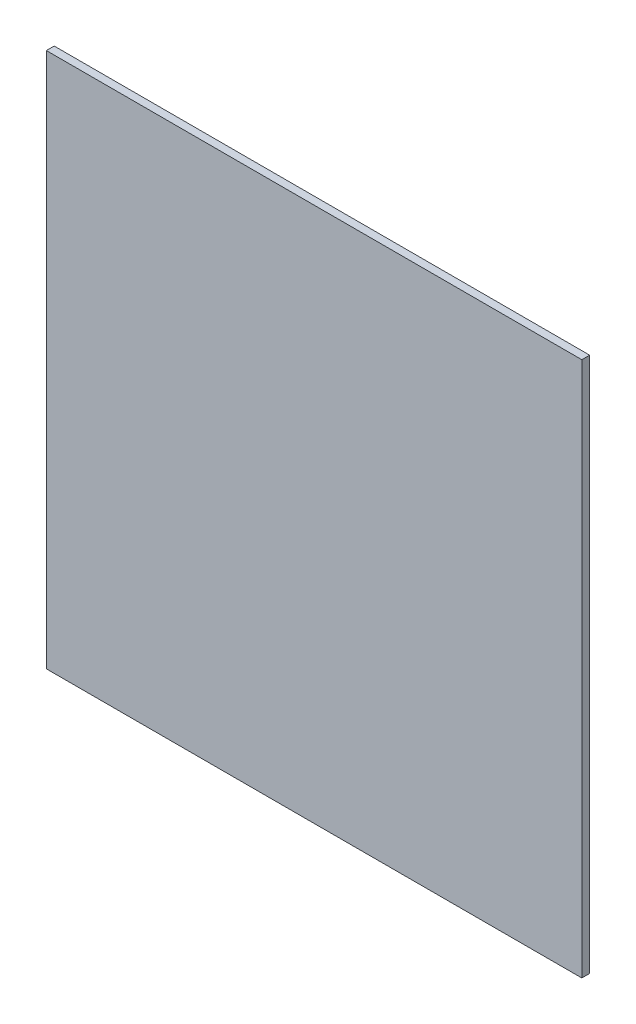
ISO-10303-21;
HEADER;
FILE_DESCRIPTION(('STEP AP214'),'2;1');
FILE_NAME('part.step','',(''),(''),'','','');
FILE_SCHEMA(('AUTOMOTIVE_DESIGN { 1 0 10303 214 1 1 1 1 }'));
ENDSEC;
DATA;
#1=APPLICATION_CONTEXT('core data for automotive mechanical design processes');
#2=APPLICATION_PROTOCOL_DEFINITION('international standard','automotive_design',2000,#1);
#3=PRODUCT_CONTEXT('',#1,'mechanical');
#4=PRODUCT('Part','Part','',(#3));
#5=PRODUCT_RELATED_PRODUCT_CATEGORY('part','',(#4));
#6=PRODUCT_DEFINITION_FORMATION('','',#4);
#7=PRODUCT_DEFINITION_CONTEXT('part definition',#1,'design');
#8=PRODUCT_DEFINITION('design','',#6,#7);
#9=PRODUCT_DEFINITION_SHAPE('','',#8);
#10=(LENGTH_UNIT() NAMED_UNIT(*) SI_UNIT(.MILLI.,.METRE.));
#11=(NAMED_UNIT(*) PLANE_ANGLE_UNIT() SI_UNIT($,.RADIAN.));
#12=(NAMED_UNIT(*) SI_UNIT($,.STERADIAN.) SOLID_ANGLE_UNIT());
#13=UNCERTAINTY_MEASURE_WITH_UNIT(LENGTH_MEASURE(1.E-05),#10,'distance_accuracy_value','');
#14=(GEOMETRIC_REPRESENTATION_CONTEXT(3) GLOBAL_UNCERTAINTY_ASSIGNED_CONTEXT((#13)) GLOBAL_UNIT_ASSIGNED_CONTEXT((#10,
#11,#12)) REPRESENTATION_CONTEXT('',''));
#15=CARTESIAN_POINT('',(0.,0.,0.));
#16=DIRECTION('',(0.,0.,1.));
#17=DIRECTION('',(1.,0.,0.));
#18=AXIS2_PLACEMENT_3D('',#15,#16,#17);
#19=CARTESIAN_POINT('',(-25.,25.,1.1));
#20=DIRECTION('',(1.,0.,0.));
#21=DIRECTION('',(0.,1.,0.));
#22=AXIS2_PLACEMENT_3D('',#19,#20,#21);
#23=PLANE('',#22);
#24=DIRECTION('',(0.,-1.,0.));
#25=VECTOR('',#24,1.);
#26=CARTESIAN_POINT('',(-25.,25.,0.));
#27=LINE('',#26,#25);
#28=CARTESIAN_POINT('',(-25.,25.,0.));
#29=VERTEX_POINT('',#28);
#30=CARTESIAN_POINT('',(-25.,-50.,0.));
#31=VERTEX_POINT('',#30);
#32=EDGE_CURVE('E96',#29,#31,#27,.T.);
#33=ORIENTED_EDGE('',*,*,#32,.T.);
#34=DIRECTION('',(0.,0.,-1.));
#35=VECTOR('',#34,1.);
#36=CARTESIAN_POINT('',(-25.,-50.,1.1));
#37=LINE('',#36,#35);
#38=CARTESIAN_POINT('',(-25.,-50.,1.1));
#39=VERTEX_POINT('',#38);
#40=EDGE_CURVE('E11',#39,#31,#37,.T.);
#41=ORIENTED_EDGE('',*,*,#40,.F.);
#42=DIRECTION('',(0.,-1.,0.));
#43=VECTOR('',#42,1.);
#44=CARTESIAN_POINT('',(-25.,25.,1.1));
#45=LINE('',#44,#43);
#46=CARTESIAN_POINT('',(-25.,25.,1.1));
#47=VERTEX_POINT('',#46);
#48=EDGE_CURVE('E84',#47,#39,#45,.T.);
#49=ORIENTED_EDGE('',*,*,#48,.F.);
#50=DIRECTION('',(0.,0.,-1.));
#51=VECTOR('',#50,1.);
#52=CARTESIAN_POINT('',(-25.,25.,1.1));
#53=LINE('',#52,#51);
#54=EDGE_CURVE('E92',#47,#29,#53,.T.);
#55=ORIENTED_EDGE('',*,*,#54,.T.);
#56=EDGE_LOOP('',(#33,#41,#49,#55));
#57=FACE_BOUND('',#56,.T.);
#58=ADVANCED_FACE('F33',(#57),#23,.F.);
#59=CARTESIAN_POINT('',(-25.,-50.,1.1));
#60=DIRECTION('',(0.,1.,0.));
#61=DIRECTION('',(0.,0.,1.));
#62=AXIS2_PLACEMENT_3D('',#59,#60,#61);
#63=PLANE('',#62);
#64=DIRECTION('',(1.,0.,0.));
#65=VECTOR('',#64,1.);
#66=CARTESIAN_POINT('',(-25.,-50.,0.));
#67=LINE('',#66,#65);
#68=CARTESIAN_POINT('',(50.,-50.,0.));
#69=VERTEX_POINT('',#68);
#70=EDGE_CURVE('E88',#31,#69,#67,.T.);
#71=ORIENTED_EDGE('',*,*,#70,.T.);
#72=DIRECTION('',(0.,0.,-1.));
#73=VECTOR('',#72,1.);
#74=CARTESIAN_POINT('',(50.,-50.,1.1));
#75=LINE('',#74,#73);
#76=CARTESIAN_POINT('',(50.,-50.,1.1));
#77=VERTEX_POINT('',#76);
#78=EDGE_CURVE('E41',#77,#69,#75,.T.);
#79=ORIENTED_EDGE('',*,*,#78,.F.);
#80=DIRECTION('',(1.,0.,0.));
#81=VECTOR('',#80,1.);
#82=CARTESIAN_POINT('',(-25.,-50.,1.1));
#83=LINE('',#82,#81);
#84=EDGE_CURVE('E79',#39,#77,#83,.T.);
#85=ORIENTED_EDGE('',*,*,#84,.F.);
#86=ORIENTED_EDGE('',*,*,#40,.T.);
#87=EDGE_LOOP('',(#71,#79,#85,#86));
#88=FACE_BOUND('',#87,.T.);
#89=ADVANCED_FACE('F87',(#88),#63,.F.);
#90=CARTESIAN_POINT('',(50.,25.,1.1));
#91=DIRECTION('',(-1.,0.,0.));
#92=DIRECTION('',(0.,-1.,0.));
#93=AXIS2_PLACEMENT_3D('',#90,#91,#92);
#94=PLANE('',#93);
#95=DIRECTION('',(0.,1.,0.));
#96=VECTOR('',#95,1.);
#97=CARTESIAN_POINT('',(50.,25.,0.));
#98=LINE('',#97,#96);
#99=CARTESIAN_POINT('',(50.,25.,0.));
#100=VERTEX_POINT('',#99);
#101=EDGE_CURVE('E66',#69,#100,#98,.T.);
#102=ORIENTED_EDGE('',*,*,#101,.T.);
#103=DIRECTION('',(0.,0.,-1.));
#104=VECTOR('',#103,1.);
#105=CARTESIAN_POINT('',(50.,25.,1.1));
#106=LINE('',#105,#104);
#107=CARTESIAN_POINT('',(50.,25.,1.1));
#108=VERTEX_POINT('',#107);
#109=EDGE_CURVE('E89',#108,#100,#106,.T.);
#110=ORIENTED_EDGE('',*,*,#109,.F.);
#111=DIRECTION('',(0.,1.,0.));
#112=VECTOR('',#111,1.);
#113=CARTESIAN_POINT('',(50.,25.,1.1));
#114=LINE('',#113,#112);
#115=EDGE_CURVE('E82',#77,#108,#114,.T.);
#116=ORIENTED_EDGE('',*,*,#115,.F.);
#117=ORIENTED_EDGE('',*,*,#78,.T.);
#118=EDGE_LOOP('',(#102,#110,#116,#117));
#119=FACE_BOUND('',#118,.T.);
#120=ADVANCED_FACE('F90',(#119),#94,.F.);
#121=CARTESIAN_POINT('',(-25.,25.,1.1));
#122=DIRECTION('',(0.,-1.,0.));
#123=DIRECTION('',(0.,0.,-1.));
#124=AXIS2_PLACEMENT_3D('',#121,#122,#123);
#125=PLANE('',#124);
#126=DIRECTION('',(-1.,0.,0.));
#127=VECTOR('',#126,1.);
#128=CARTESIAN_POINT('',(-25.,25.,0.));
#129=LINE('',#128,#127);
#130=EDGE_CURVE('E72',#100,#29,#129,.T.);
#131=ORIENTED_EDGE('',*,*,#130,.T.);
#132=ORIENTED_EDGE('',*,*,#54,.F.);
#133=DIRECTION('',(-1.,0.,0.));
#134=VECTOR('',#133,1.);
#135=CARTESIAN_POINT('',(-25.,25.,1.1));
#136=LINE('',#135,#134);
#137=EDGE_CURVE('E49',#108,#47,#136,.T.);
#138=ORIENTED_EDGE('',*,*,#137,.F.);
#139=ORIENTED_EDGE('',*,*,#109,.T.);
#140=EDGE_LOOP('',(#131,#132,#138,#139));
#141=FACE_BOUND('',#140,.T.);
#142=ADVANCED_FACE('F103',(#141),#125,.F.);
#143=CARTESIAN_POINT('',(0.,0.,1.1));
#144=DIRECTION('',(0.,0.,1.));
#145=DIRECTION('',(1.,0.,0.));
#146=AXIS2_PLACEMENT_3D('',#143,#144,#145);
#147=PLANE('',#146);
#148=ORIENTED_EDGE('',*,*,#48,.T.);
#149=ORIENTED_EDGE('',*,*,#84,.T.);
#150=ORIENTED_EDGE('',*,*,#115,.T.);
#151=ORIENTED_EDGE('',*,*,#137,.T.);
#152=EDGE_LOOP('',(#148,#149,#150,#151));
#153=FACE_BOUND('',#152,.T.);
#154=ADVANCED_FACE('F80',(#153),#147,.T.);
#155=CARTESIAN_POINT('',(0.,0.,0.));
#156=DIRECTION('',(0.,0.,1.));
#157=DIRECTION('',(1.,0.,0.));
#158=AXIS2_PLACEMENT_3D('',#155,#156,#157);
#159=PLANE('',#158);
#160=ORIENTED_EDGE('',*,*,#32,.F.);
#161=ORIENTED_EDGE('',*,*,#130,.F.);
#162=ORIENTED_EDGE('',*,*,#101,.F.);
#163=ORIENTED_EDGE('',*,*,#70,.F.);
#164=EDGE_LOOP('',(#160,#161,#162,#163));
#165=FACE_BOUND('',#164,.T.);
#166=ADVANCED_FACE('F106',(#165),#159,.F.);
#167=CLOSED_SHELL('',(#58,#89,#120,#142,#154,#166));
#168=MANIFOLD_SOLID_BREP('B2',#167);
#169=ADVANCED_BREP_SHAPE_REPRESENTATION('',(#18,#168),#14);
#170=SHAPE_DEFINITION_REPRESENTATION(#9,#169);
ENDSEC;
END-ISO-10303-21;
